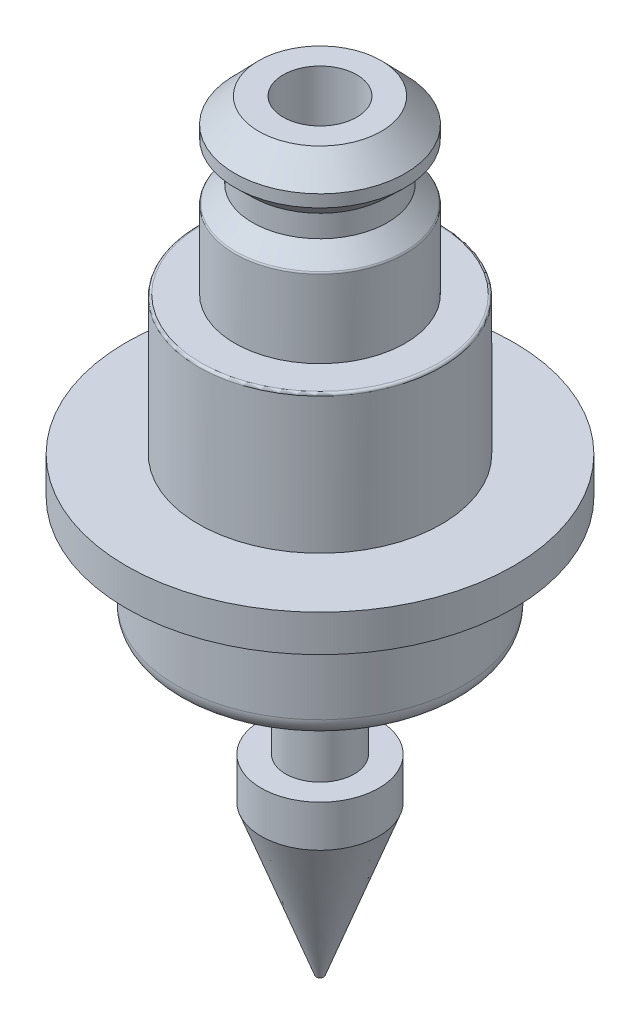
ISO-10303-21;
HEADER;
FILE_DESCRIPTION(('STEP AP214'),'2;1');
FILE_NAME('part.step','',(''),(''),'','','');
FILE_SCHEMA(('AUTOMOTIVE_DESIGN { 1 0 10303 214 1 1 1 1 }'));
ENDSEC;
DATA;
#1=APPLICATION_CONTEXT('core data for automotive mechanical design processes');
#2=APPLICATION_PROTOCOL_DEFINITION('international standard','automotive_design',2000,#1);
#3=PRODUCT_CONTEXT('',#1,'mechanical');
#4=PRODUCT('Part','Part','',(#3));
#5=PRODUCT_RELATED_PRODUCT_CATEGORY('part','',(#4));
#6=PRODUCT_DEFINITION_FORMATION('','',#4);
#7=PRODUCT_DEFINITION_CONTEXT('part definition',#1,'design');
#8=PRODUCT_DEFINITION('design','',#6,#7);
#9=PRODUCT_DEFINITION_SHAPE('','',#8);
#10=(LENGTH_UNIT() NAMED_UNIT(*) SI_UNIT(.MILLI.,.METRE.));
#11=(NAMED_UNIT(*) PLANE_ANGLE_UNIT() SI_UNIT($,.RADIAN.));
#12=(NAMED_UNIT(*) SI_UNIT($,.STERADIAN.) SOLID_ANGLE_UNIT());
#13=UNCERTAINTY_MEASURE_WITH_UNIT(LENGTH_MEASURE(1.E-05),#10,'distance_accuracy_value','');
#14=(GEOMETRIC_REPRESENTATION_CONTEXT(3) GLOBAL_UNCERTAINTY_ASSIGNED_CONTEXT((#13)) GLOBAL_UNIT_ASSIGNED_CONTEXT((#10,
#11,#12)) REPRESENTATION_CONTEXT('',''));
#15=CARTESIAN_POINT('',(0.,0.,0.));
#16=DIRECTION('',(0.,0.,1.));
#17=DIRECTION('',(1.,0.,0.));
#18=AXIS2_PLACEMENT_3D('',#15,#16,#17);
#19=CARTESIAN_POINT('',(0.,0.,0.));
#20=DIRECTION('',(0.,-1.,0.));
#21=DIRECTION('',(0.,0.,-1.));
#22=AXIS2_PLACEMENT_3D('',#19,#20,#21);
#23=CYLINDRICAL_SURFACE('',#22,1.5);
#24=CARTESIAN_POINT('',(0.,0.,0.));
#25=DIRECTION('',(0.,-1.,0.));
#26=DIRECTION('',(0.,0.,-1.));
#27=AXIS2_PLACEMENT_3D('',#24,#25,#26);
#28=CIRCLE('',#27,1.5);
#29=CARTESIAN_POINT('',(0.,0.,-1.5));
#30=VERTEX_POINT('',#29);
#31=EDGE_CURVE('E110',#30,#30,#28,.T.);
#32=ORIENTED_EDGE('',*,*,#31,.T.);
#33=EDGE_LOOP('',(#32));
#34=FACE_BOUND('',#33,.T.);
#35=CARTESIAN_POINT('',(0.,14.15,0.));
#36=DIRECTION('',(0.,-1.,0.));
#37=DIRECTION('',(0.,0.,-1.));
#38=AXIS2_PLACEMENT_3D('',#35,#36,#37);
#39=CIRCLE('',#38,1.5);
#40=CARTESIAN_POINT('',(0.,14.15,-1.5));
#41=VERTEX_POINT('',#40);
#42=EDGE_CURVE('E59',#41,#41,#39,.T.);
#43=ORIENTED_EDGE('',*,*,#42,.F.);
#44=EDGE_LOOP('',(#43));
#45=FACE_BOUND('',#44,.T.);
#46=ADVANCED_FACE('F33',(#34,#45),#23,.F.);
#47=CARTESIAN_POINT('',(1.5,14.15,0.));
#48=DIRECTION('',(0.,1.,0.));
#49=DIRECTION('',(0.,0.,1.));
#50=AXIS2_PLACEMENT_3D('',#47,#48,#49);
#51=PLANE('',#50);
#52=ORIENTED_EDGE('',*,*,#42,.T.);
#53=EDGE_LOOP('',(#52));
#54=FACE_BOUND('',#53,.T.);
#55=CARTESIAN_POINT('',(0.,14.15,0.));
#56=DIRECTION('',(0.,-1.,0.));
#57=DIRECTION('',(0.,0.,-1.));
#58=AXIS2_PLACEMENT_3D('',#55,#56,#57);
#59=CIRCLE('',#58,2.5);
#60=CARTESIAN_POINT('',(0.,14.15,-2.5));
#61=VERTEX_POINT('',#60);
#62=EDGE_CURVE('E62',#61,#61,#59,.T.);
#63=ORIENTED_EDGE('',*,*,#62,.F.);
#64=EDGE_LOOP('',(#63));
#65=FACE_BOUND('',#64,.T.);
#66=ADVANCED_FACE('F133',(#54,#65),#51,.T.);
#67=CARTESIAN_POINT('',(0.,13.15,0.));
#68=DIRECTION('',(0.,-1.,0.));
#69=DIRECTION('',(0.,0.,-1.));
#70=AXIS2_PLACEMENT_3D('',#67,#68,#69);
#71=CONICAL_SURFACE('',#70,3.475,0.772740611563396);
#72=ORIENTED_EDGE('',*,*,#62,.T.);
#73=EDGE_LOOP('',(#72));
#74=FACE_BOUND('',#73,.T.);
#75=CARTESIAN_POINT('',(0.,13.15,0.));
#76=DIRECTION('',(0.,-1.,0.));
#77=DIRECTION('',(0.,0.,-1.));
#78=AXIS2_PLACEMENT_3D('',#75,#76,#77);
#79=CIRCLE('',#78,3.475);
#80=CARTESIAN_POINT('',(0.,13.15,-3.475));
#81=VERTEX_POINT('',#80);
#82=EDGE_CURVE('E65',#81,#81,#79,.T.);
#83=ORIENTED_EDGE('',*,*,#82,.F.);
#84=EDGE_LOOP('',(#83));
#85=FACE_BOUND('',#84,.T.);
#86=ADVANCED_FACE('F138',(#74,#85),#71,.T.);
#87=CARTESIAN_POINT('',(0.,0.,0.));
#88=DIRECTION('',(0.,-1.,0.));
#89=DIRECTION('',(0.,0.,-1.));
#90=AXIS2_PLACEMENT_3D('',#87,#88,#89);
#91=CYLINDRICAL_SURFACE('',#90,3.475);
#92=ORIENTED_EDGE('',*,*,#82,.T.);
#93=EDGE_LOOP('',(#92));
#94=FACE_BOUND('',#93,.T.);
#95=CARTESIAN_POINT('',(0.,12.65,0.));
#96=DIRECTION('',(0.,-1.,0.));
#97=DIRECTION('',(0.,0.,-1.));
#98=AXIS2_PLACEMENT_3D('',#95,#96,#97);
#99=CIRCLE('',#98,3.475);
#100=CARTESIAN_POINT('',(0.,12.65,-3.475));
#101=VERTEX_POINT('',#100);
#102=EDGE_CURVE('E68',#101,#101,#99,.T.);
#103=ORIENTED_EDGE('',*,*,#102,.F.);
#104=EDGE_LOOP('',(#103));
#105=FACE_BOUND('',#104,.T.);
#106=ADVANCED_FACE('F180',(#94,#105),#91,.T.);
#107=CARTESIAN_POINT('',(0.,11.95,0.));
#108=DIRECTION('',(0.,1.,0.));
#109=DIRECTION('',(0.,0.,1.));
#110=AXIS2_PLACEMENT_3D('',#107,#108,#109);
#111=CONICAL_SURFACE('',#110,2.75,0.80294022345485);
#112=ORIENTED_EDGE('',*,*,#102,.T.);
#113=EDGE_LOOP('',(#112));
#114=FACE_BOUND('',#113,.T.);
#115=CARTESIAN_POINT('',(0.,11.95,0.));
#116=DIRECTION('',(0.,-1.,0.));
#117=DIRECTION('',(0.,0.,-1.));
#118=AXIS2_PLACEMENT_3D('',#115,#116,#117);
#119=CIRCLE('',#118,2.75);
#120=CARTESIAN_POINT('',(0.,11.95,-2.75));
#121=VERTEX_POINT('',#120);
#122=EDGE_CURVE('E71',#121,#121,#119,.T.);
#123=ORIENTED_EDGE('',*,*,#122,.F.);
#124=EDGE_LOOP('',(#123));
#125=FACE_BOUND('',#124,.T.);
#126=ADVANCED_FACE('F176',(#114,#125),#111,.T.);
#127=CARTESIAN_POINT('',(0.,0.,0.));
#128=DIRECTION('',(0.,-1.,0.));
#129=DIRECTION('',(0.,0.,-1.));
#130=AXIS2_PLACEMENT_3D('',#127,#128,#129);
#131=CYLINDRICAL_SURFACE('',#130,2.75);
#132=ORIENTED_EDGE('',*,*,#122,.T.);
#133=EDGE_LOOP('',(#132));
#134=FACE_BOUND('',#133,.T.);
#135=CARTESIAN_POINT('',(0.,11.05,0.));
#136=DIRECTION('',(0.,-1.,0.));
#137=DIRECTION('',(0.,0.,-1.));
#138=AXIS2_PLACEMENT_3D('',#135,#136,#137);
#139=CIRCLE('',#138,2.75);
#140=CARTESIAN_POINT('',(0.,11.05,-2.75));
#141=VERTEX_POINT('',#140);
#142=EDGE_CURVE('E74',#141,#141,#139,.T.);
#143=ORIENTED_EDGE('',*,*,#142,.F.);
#144=EDGE_LOOP('',(#143));
#145=FACE_BOUND('',#144,.T.);
#146=ADVANCED_FACE('F172',(#134,#145),#131,.T.);
#147=CARTESIAN_POINT('',(0.,10.35,0.));
#148=DIRECTION('',(0.,-1.,0.));
#149=DIRECTION('',(0.,0.,-1.));
#150=AXIS2_PLACEMENT_3D('',#147,#148,#149);
#151=CONICAL_SURFACE('',#150,3.475,0.802940223454851);
#152=CARTESIAN_POINT('',(0.,10.3794874262635,0.));
#153=DIRECTION('',(0.,1.,0.));
#154=DIRECTION('',(0.,0.,1.));
#155=AXIS2_PLACEMENT_3D('',#152,#153,#154);
#156=CIRCLE('',#155,3.44445945136996);
#157=CARTESIAN_POINT('',(0.,10.3794874262635,3.44445945136996));
#158=VERTEX_POINT('',#157);
#159=EDGE_CURVE('E44',#158,#158,#156,.T.);
#160=ORIENTED_EDGE('',*,*,#159,.T.);
#161=EDGE_LOOP('',(#160));
#162=FACE_BOUND('',#161,.T.);
#163=ORIENTED_EDGE('',*,*,#142,.T.);
#164=EDGE_LOOP('',(#163));
#165=FACE_BOUND('',#164,.T.);
#166=ADVANCED_FACE('F156',(#162,#165),#151,.T.);
#167=CARTESIAN_POINT('',(0.,0.,0.));
#168=DIRECTION('',(0.,-1.,0.));
#169=DIRECTION('',(0.,0.,-1.));
#170=AXIS2_PLACEMENT_3D('',#167,#168,#169);
#171=CYLINDRICAL_SURFACE('',#170,3.475);
#172=CARTESIAN_POINT('',(0.,10.3075472802017,0.));
#173=DIRECTION('',(0.,1.,0.));
#174=DIRECTION('',(0.,0.,1.));
#175=AXIS2_PLACEMENT_3D('',#172,#173,#174);
#176=CIRCLE('',#175,3.475);
#177=CARTESIAN_POINT('',(0.,10.3075472802017,3.475));
#178=VERTEX_POINT('',#177);
#179=EDGE_CURVE('E48',#178,#178,#176,.F.);
#180=ORIENTED_EDGE('',*,*,#179,.T.);
#181=EDGE_LOOP('',(#180));
#182=FACE_BOUND('',#181,.T.);
#183=CARTESIAN_POINT('',(0.,7.15,0.));
#184=DIRECTION('',(0.,-1.,0.));
#185=DIRECTION('',(0.,0.,-1.));
#186=AXIS2_PLACEMENT_3D('',#183,#184,#185);
#187=CIRCLE('',#186,3.475);
#188=CARTESIAN_POINT('',(0.,7.15,-3.475));
#189=VERTEX_POINT('',#188);
#190=EDGE_CURVE('E77',#189,#189,#187,.T.);
#191=ORIENTED_EDGE('',*,*,#190,.F.);
#192=EDGE_LOOP('',(#191));
#193=FACE_BOUND('',#192,.T.);
#194=ADVANCED_FACE('F152',(#182,#193),#171,.T.);
#195=CARTESIAN_POINT('',(3.475,7.15,0.));
#196=DIRECTION('',(0.,1.,0.));
#197=DIRECTION('',(0.,0.,1.));
#198=AXIS2_PLACEMENT_3D('',#195,#196,#197);
#199=PLANE('',#198);
#200=CARTESIAN_POINT('',(0.,7.15,0.));
#201=DIRECTION('',(0.,1.,0.));
#202=DIRECTION('',(0.,0.,1.));
#203=AXIS2_PLACEMENT_3D('',#200,#201,#202);
#204=CIRCLE('',#203,4.855);
#205=CARTESIAN_POINT('',(0.,7.15,4.855));
#206=VERTEX_POINT('',#205);
#207=EDGE_CURVE('E10',#206,#206,#204,.T.);
#208=ORIENTED_EDGE('',*,*,#207,.T.);
#209=EDGE_LOOP('',(#208));
#210=FACE_BOUND('',#209,.T.);
#211=ORIENTED_EDGE('',*,*,#190,.T.);
#212=EDGE_LOOP('',(#211));
#213=FACE_BOUND('',#212,.T.);
#214=ADVANCED_FACE('F155',(#210,#213),#199,.T.);
#215=CARTESIAN_POINT('',(0.,0.,0.));
#216=DIRECTION('',(0.,-1.,0.));
#217=DIRECTION('',(0.,0.,-1.));
#218=AXIS2_PLACEMENT_3D('',#215,#216,#217);
#219=CYLINDRICAL_SURFACE('',#218,4.955);
#220=CARTESIAN_POINT('',(0.,7.05,0.));
#221=DIRECTION('',(0.,1.,0.));
#222=DIRECTION('',(0.,0.,1.));
#223=AXIS2_PLACEMENT_3D('',#220,#221,#222);
#224=CIRCLE('',#223,4.955);
#225=CARTESIAN_POINT('',(0.,7.05,4.955));
#226=VERTEX_POINT('',#225);
#227=EDGE_CURVE('E40',#226,#226,#224,.F.);
#228=ORIENTED_EDGE('',*,*,#227,.T.);
#229=EDGE_LOOP('',(#228));
#230=FACE_BOUND('',#229,.T.);
#231=CARTESIAN_POINT('',(0.,1.5,0.));
#232=DIRECTION('',(0.,-1.,0.));
#233=DIRECTION('',(0.,0.,-1.));
#234=AXIS2_PLACEMENT_3D('',#231,#232,#233);
#235=CIRCLE('',#234,4.955);
#236=CARTESIAN_POINT('',(0.,1.5,-4.955));
#237=VERTEX_POINT('',#236);
#238=EDGE_CURVE('E80',#237,#237,#235,.T.);
#239=ORIENTED_EDGE('',*,*,#238,.F.);
#240=EDGE_LOOP('',(#239));
#241=FACE_BOUND('',#240,.T.);
#242=ADVANCED_FACE('F161',(#230,#241),#219,.T.);
#243=CARTESIAN_POINT('',(4.955,1.5,0.));
#244=DIRECTION('',(0.,1.,0.));
#245=DIRECTION('',(0.,0.,1.));
#246=AXIS2_PLACEMENT_3D('',#243,#244,#245);
#247=PLANE('',#246);
#248=ORIENTED_EDGE('',*,*,#238,.T.);
#249=EDGE_LOOP('',(#248));
#250=FACE_BOUND('',#249,.T.);
#251=CARTESIAN_POINT('',(0.,1.5,0.));
#252=DIRECTION('',(0.,-1.,0.));
#253=DIRECTION('',(0.,0.,-1.));
#254=AXIS2_PLACEMENT_3D('',#251,#252,#253);
#255=CIRCLE('',#254,7.9);
#256=CARTESIAN_POINT('',(0.,1.5,-7.9));
#257=VERTEX_POINT('',#256);
#258=EDGE_CURVE('E83',#257,#257,#255,.T.);
#259=ORIENTED_EDGE('',*,*,#258,.F.);
#260=EDGE_LOOP('',(#259));
#261=FACE_BOUND('',#260,.T.);
#262=ADVANCED_FACE('F166',(#250,#261),#247,.T.);
#263=CARTESIAN_POINT('',(0.,0.,0.));
#264=DIRECTION('',(0.,-1.,0.));
#265=DIRECTION('',(0.,0.,-1.));
#266=AXIS2_PLACEMENT_3D('',#263,#264,#265);
#267=CYLINDRICAL_SURFACE('',#266,7.9);
#268=ORIENTED_EDGE('',*,*,#258,.T.);
#269=EDGE_LOOP('',(#268));
#270=FACE_BOUND('',#269,.T.);
#271=CARTESIAN_POINT('',(0.,0.,0.));
#272=DIRECTION('',(0.,-1.,0.));
#273=DIRECTION('',(0.,0.,-1.));
#274=AXIS2_PLACEMENT_3D('',#271,#272,#273);
#275=CIRCLE('',#274,7.9);
#276=CARTESIAN_POINT('',(0.,0.,-7.9));
#277=VERTEX_POINT('',#276);
#278=EDGE_CURVE('E86',#277,#277,#275,.T.);
#279=ORIENTED_EDGE('',*,*,#278,.F.);
#280=EDGE_LOOP('',(#279));
#281=FACE_BOUND('',#280,.T.);
#282=ADVANCED_FACE('F328',(#270,#281),#267,.T.);
#283=CARTESIAN_POINT('',(7.9,0.,0.));
#284=DIRECTION('',(0.,-1.,0.));
#285=DIRECTION('',(0.,0.,-1.));
#286=AXIS2_PLACEMENT_3D('',#283,#284,#285);
#287=PLANE('',#286);
#288=ORIENTED_EDGE('',*,*,#278,.T.);
#289=EDGE_LOOP('',(#288));
#290=FACE_BOUND('',#289,.T.);
#291=CARTESIAN_POINT('',(0.,0.,0.));
#292=DIRECTION('',(0.,-1.,0.));
#293=DIRECTION('',(0.,0.,-1.));
#294=AXIS2_PLACEMENT_3D('',#291,#292,#293);
#295=CIRCLE('',#294,5.85);
#296=CARTESIAN_POINT('',(0.,0.,-5.85));
#297=VERTEX_POINT('',#296);
#298=EDGE_CURVE('E89',#297,#297,#295,.T.);
#299=ORIENTED_EDGE('',*,*,#298,.F.);
#300=EDGE_LOOP('',(#299));
#301=FACE_BOUND('',#300,.T.);
#302=ADVANCED_FACE('F319',(#290,#301),#287,.T.);
#303=CARTESIAN_POINT('',(0.,0.,0.));
#304=DIRECTION('',(0.,-1.,0.));
#305=DIRECTION('',(0.,0.,-1.));
#306=AXIS2_PLACEMENT_3D('',#303,#304,#305);
#307=CYLINDRICAL_SURFACE('',#306,5.85);
#308=CARTESIAN_POINT('',(0.,-3.75,0.));
#309=DIRECTION('',(0.,-1.,0.));
#310=DIRECTION('',(0.,0.,-1.));
#311=AXIS2_PLACEMENT_3D('',#308,#309,#310);
#312=CIRCLE('',#311,5.85);
#313=CARTESIAN_POINT('',(0.,-3.75,-5.85));
#314=VERTEX_POINT('',#313);
#315=EDGE_CURVE('E53',#314,#314,#312,.F.);
#316=ORIENTED_EDGE('',*,*,#315,.T.);
#317=EDGE_LOOP('',(#316));
#318=FACE_BOUND('',#317,.T.);
#319=ORIENTED_EDGE('',*,*,#298,.T.);
#320=EDGE_LOOP('',(#319));
#321=FACE_BOUND('',#320,.T.);
#322=ADVANCED_FACE('F310',(#318,#321),#307,.T.);
#323=CARTESIAN_POINT('',(5.85,-4.5,0.));
#324=DIRECTION('',(0.,-1.,0.));
#325=DIRECTION('',(0.,0.,-1.));
#326=AXIS2_PLACEMENT_3D('',#323,#324,#325);
#327=PLANE('',#326);
#328=CARTESIAN_POINT('',(0.,-4.5,0.));
#329=DIRECTION('',(0.,-1.,0.));
#330=DIRECTION('',(0.,0.,-1.));
#331=AXIS2_PLACEMENT_3D('',#328,#329,#330);
#332=CIRCLE('',#331,5.1);
#333=CARTESIAN_POINT('',(0.,-4.5,-5.1));
#334=VERTEX_POINT('',#333);
#335=EDGE_CURVE('E56',#334,#334,#332,.T.);
#336=ORIENTED_EDGE('',*,*,#335,.T.);
#337=EDGE_LOOP('',(#336));
#338=FACE_BOUND('',#337,.T.);
#339=CARTESIAN_POINT('',(0.,-4.5,0.));
#340=DIRECTION('',(0.,-1.,0.));
#341=DIRECTION('',(0.,0.,-1.));
#342=AXIS2_PLACEMENT_3D('',#339,#340,#341);
#343=CIRCLE('',#342,1.4);
#344=CARTESIAN_POINT('',(0.,-4.5,-1.4));
#345=VERTEX_POINT('',#344);
#346=EDGE_CURVE('E92',#345,#345,#343,.T.);
#347=ORIENTED_EDGE('',*,*,#346,.F.);
#348=EDGE_LOOP('',(#347));
#349=FACE_BOUND('',#348,.T.);
#350=ADVANCED_FACE('F301',(#338,#349),#327,.T.);
#351=CARTESIAN_POINT('',(0.,0.,0.));
#352=DIRECTION('',(0.,-1.,0.));
#353=DIRECTION('',(0.,0.,-1.));
#354=AXIS2_PLACEMENT_3D('',#351,#352,#353);
#355=CYLINDRICAL_SURFACE('',#354,1.4);
#356=ORIENTED_EDGE('',*,*,#346,.T.);
#357=EDGE_LOOP('',(#356));
#358=FACE_BOUND('',#357,.T.);
#359=CARTESIAN_POINT('',(0.,-9.1,0.));
#360=DIRECTION('',(0.,-1.,0.));
#361=DIRECTION('',(0.,0.,-1.));
#362=AXIS2_PLACEMENT_3D('',#359,#360,#361);
#363=CIRCLE('',#362,1.4);
#364=CARTESIAN_POINT('',(0.,-9.1,-1.4));
#365=VERTEX_POINT('',#364);
#366=EDGE_CURVE('E95',#365,#365,#363,.T.);
#367=ORIENTED_EDGE('',*,*,#366,.F.);
#368=EDGE_LOOP('',(#367));
#369=FACE_BOUND('',#368,.T.);
#370=ADVANCED_FACE('F291',(#358,#369),#355,.T.);
#371=CARTESIAN_POINT('',(1.4,-9.1,0.));
#372=DIRECTION('',(0.,1.,0.));
#373=DIRECTION('',(0.,0.,1.));
#374=AXIS2_PLACEMENT_3D('',#371,#372,#373);
#375=PLANE('',#374);
#376=ORIENTED_EDGE('',*,*,#366,.T.);
#377=EDGE_LOOP('',(#376));
#378=FACE_BOUND('',#377,.T.);
#379=CARTESIAN_POINT('',(0.,-9.1,0.));
#380=DIRECTION('',(0.,-1.,0.));
#381=DIRECTION('',(0.,0.,-1.));
#382=AXIS2_PLACEMENT_3D('',#379,#380,#381);
#383=CIRCLE('',#382,2.4);
#384=CARTESIAN_POINT('',(0.,-9.1,-2.4));
#385=VERTEX_POINT('',#384);
#386=EDGE_CURVE('E98',#385,#385,#383,.T.);
#387=ORIENTED_EDGE('',*,*,#386,.F.);
#388=EDGE_LOOP('',(#387));
#389=FACE_BOUND('',#388,.T.);
#390=ADVANCED_FACE('F281',(#378,#389),#375,.T.);
#391=CARTESIAN_POINT('',(0.,0.,0.));
#392=DIRECTION('',(0.,-1.,0.));
#393=DIRECTION('',(0.,0.,-1.));
#394=AXIS2_PLACEMENT_3D('',#391,#392,#393);
#395=CYLINDRICAL_SURFACE('',#394,2.4);
#396=ORIENTED_EDGE('',*,*,#386,.T.);
#397=EDGE_LOOP('',(#396));
#398=FACE_BOUND('',#397,.T.);
#399=CARTESIAN_POINT('',(0.,-10.8,0.));
#400=DIRECTION('',(0.,-1.,0.));
#401=DIRECTION('',(0.,0.,-1.));
#402=AXIS2_PLACEMENT_3D('',#399,#400,#401);
#403=CIRCLE('',#402,2.4);
#404=CARTESIAN_POINT('',(0.,-10.8,-2.4));
#405=VERTEX_POINT('',#404);
#406=EDGE_CURVE('E101',#405,#405,#403,.T.);
#407=ORIENTED_EDGE('',*,*,#406,.F.);
#408=EDGE_LOOP('',(#407));
#409=FACE_BOUND('',#408,.T.);
#410=ADVANCED_FACE('F271',(#398,#409),#395,.T.);
#411=CARTESIAN_POINT('',(0.,-16.9,0.));
#412=DIRECTION('',(0.,1.,0.));
#413=DIRECTION('',(0.,0.,1.));
#414=AXIS2_PLACEMENT_3D('',#411,#412,#413);
#415=CONICAL_SURFACE('',#414,0.15,0.353370182719398);
#416=ORIENTED_EDGE('',*,*,#406,.T.);
#417=EDGE_LOOP('',(#416));
#418=FACE_BOUND('',#417,.T.);
#419=CARTESIAN_POINT('',(0.,-16.9,0.));
#420=DIRECTION('',(0.,-1.,0.));
#421=DIRECTION('',(0.,0.,-1.));
#422=AXIS2_PLACEMENT_3D('',#419,#420,#421);
#423=CIRCLE('',#422,0.15);
#424=CARTESIAN_POINT('',(0.,-16.9,-0.15));
#425=VERTEX_POINT('',#424);
#426=EDGE_CURVE('E104',#425,#425,#423,.T.);
#427=ORIENTED_EDGE('',*,*,#426,.F.);
#428=EDGE_LOOP('',(#427));
#429=FACE_BOUND('',#428,.T.);
#430=ADVANCED_FACE('F129',(#418,#429),#415,.T.);
#431=CARTESIAN_POINT('',(0.,0.,0.));
#432=DIRECTION('',(0.,-1.,0.));
#433=DIRECTION('',(0.,0.,-1.));
#434=AXIS2_PLACEMENT_3D('',#431,#432,#433);
#435=CYLINDRICAL_SURFACE('',#434,0.15);
#436=ORIENTED_EDGE('',*,*,#426,.T.);
#437=EDGE_LOOP('',(#436));
#438=FACE_BOUND('',#437,.T.);
#439=CARTESIAN_POINT('',(0.,0.,0.));
#440=DIRECTION('',(0.,-1.,0.));
#441=DIRECTION('',(0.,0.,-1.));
#442=AXIS2_PLACEMENT_3D('',#439,#440,#441);
#443=CIRCLE('',#442,0.15);
#444=CARTESIAN_POINT('',(0.,0.,-0.15));
#445=VERTEX_POINT('',#444);
#446=EDGE_CURVE('E107',#445,#445,#443,.T.);
#447=ORIENTED_EDGE('',*,*,#446,.F.);
#448=EDGE_LOOP('',(#447));
#449=FACE_BOUND('',#448,.T.);
#450=ADVANCED_FACE('F119',(#438,#449),#435,.F.);
#451=CARTESIAN_POINT('',(0.15,0.,0.));
#452=DIRECTION('',(0.,1.,0.));
#453=DIRECTION('',(0.,0.,1.));
#454=AXIS2_PLACEMENT_3D('',#451,#452,#453);
#455=PLANE('',#454);
#456=ORIENTED_EDGE('',*,*,#446,.T.);
#457=EDGE_LOOP('',(#456));
#458=FACE_BOUND('',#457,.T.);
#459=ORIENTED_EDGE('',*,*,#31,.F.);
#460=EDGE_LOOP('',(#459));
#461=FACE_BOUND('',#460,.T.);
#462=ADVANCED_FACE('F116',(#458,#461),#455,.T.);
#463=CARTESIAN_POINT('',(0.,-3.75,0.));
#464=DIRECTION('',(0.,-1.,0.));
#465=DIRECTION('',(0.,0.,-1.));
#466=AXIS2_PLACEMENT_3D('',#463,#464,#465);
#467=TOROIDAL_SURFACE('',#466,5.1,0.75);
#468=ORIENTED_EDGE('',*,*,#315,.F.);
#469=EDGE_LOOP('',(#468));
#470=FACE_BOUND('',#469,.T.);
#471=ORIENTED_EDGE('',*,*,#335,.F.);
#472=EDGE_LOOP('',(#471));
#473=FACE_BOUND('',#472,.T.);
#474=ADVANCED_FACE('F118',(#470,#473),#467,.T.);
#475=CARTESIAN_POINT('',(0.,10.3075472802017,0.));
#476=DIRECTION('',(0.,1.,0.));
#477=DIRECTION('',(0.,0.,1.));
#478=AXIS2_PLACEMENT_3D('',#475,#476,#477);
#479=TOROIDAL_SURFACE('',#478,3.375,0.1);
#480=ORIENTED_EDGE('',*,*,#159,.F.);
#481=EDGE_LOOP('',(#480));
#482=FACE_BOUND('',#481,.T.);
#483=ORIENTED_EDGE('',*,*,#179,.F.);
#484=EDGE_LOOP('',(#483));
#485=FACE_BOUND('',#484,.T.);
#486=ADVANCED_FACE('F126',(#482,#485),#479,.T.);
#487=CARTESIAN_POINT('',(0.,7.05,0.));
#488=DIRECTION('',(0.,1.,0.));
#489=DIRECTION('',(0.,0.,1.));
#490=AXIS2_PLACEMENT_3D('',#487,#488,#489);
#491=TOROIDAL_SURFACE('',#490,4.855,0.1);
#492=ORIENTED_EDGE('',*,*,#207,.F.);
#493=EDGE_LOOP('',(#492));
#494=FACE_BOUND('',#493,.T.);
#495=ORIENTED_EDGE('',*,*,#227,.F.);
#496=EDGE_LOOP('',(#495));
#497=FACE_BOUND('',#496,.T.);
#498=ADVANCED_FACE('F35',(#494,#497),#491,.T.);
#499=CLOSED_SHELL('',(#46,#66,#86,#106,#126,#146,#166,#194,#214,#242,#262,#282,#302,#322,#350,
#370,#390,#410,#430,#450,#462,#474,#486,#498));
#500=MANIFOLD_SOLID_BREP('B2',#499);
#501=ADVANCED_BREP_SHAPE_REPRESENTATION('',(#18,#500),#14);
#502=SHAPE_DEFINITION_REPRESENTATION(#9,#501);
ENDSEC;
END-ISO-10303-21;
